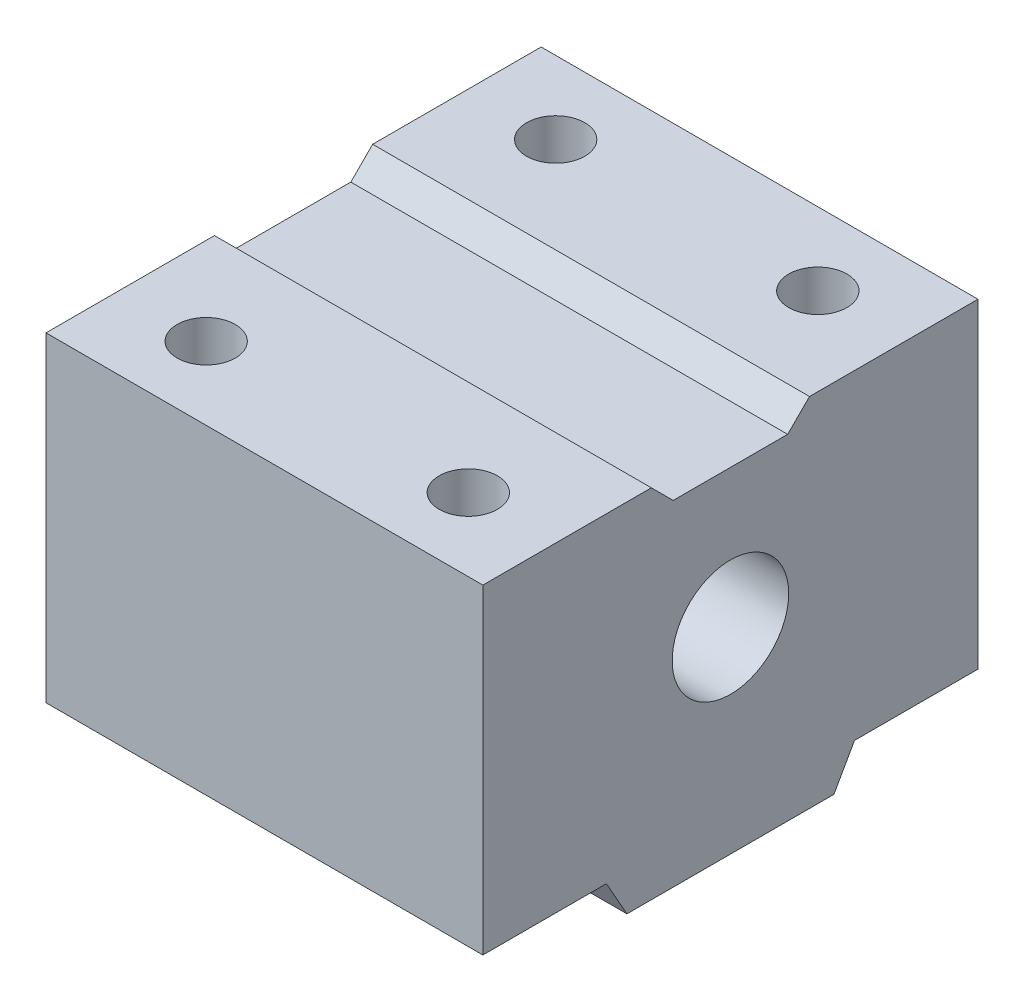
ISO-10303-21;
HEADER;
FILE_DESCRIPTION(('STEP AP214'),'2;1');
FILE_NAME('part.step','',(''),(''),'','','');
FILE_SCHEMA(('AUTOMOTIVE_DESIGN { 1 0 10303 214 1 1 1 1 }'));
ENDSEC;
DATA;
#1=APPLICATION_CONTEXT('core data for automotive mechanical design processes');
#2=APPLICATION_PROTOCOL_DEFINITION('international standard','automotive_design',2000,#1);
#3=PRODUCT_CONTEXT('',#1,'mechanical');
#4=PRODUCT('Part','Part','',(#3));
#5=PRODUCT_RELATED_PRODUCT_CATEGORY('part','',(#4));
#6=PRODUCT_DEFINITION_FORMATION('','',#4);
#7=PRODUCT_DEFINITION_CONTEXT('part definition',#1,'design');
#8=PRODUCT_DEFINITION('design','',#6,#7);
#9=PRODUCT_DEFINITION_SHAPE('','',#8);
#10=(LENGTH_UNIT() NAMED_UNIT(*) SI_UNIT(.MILLI.,.METRE.));
#11=(NAMED_UNIT(*) PLANE_ANGLE_UNIT() SI_UNIT($,.RADIAN.));
#12=(NAMED_UNIT(*) SI_UNIT($,.STERADIAN.) SOLID_ANGLE_UNIT());
#13=UNCERTAINTY_MEASURE_WITH_UNIT(LENGTH_MEASURE(1.E-05),#10,'distance_accuracy_value','');
#14=(GEOMETRIC_REPRESENTATION_CONTEXT(3) GLOBAL_UNCERTAINTY_ASSIGNED_CONTEXT((#13)) GLOBAL_UNIT_ASSIGNED_CONTEXT((#10,
#11,#12)) REPRESENTATION_CONTEXT('',''));
#15=CARTESIAN_POINT('',(0.,0.,0.));
#16=DIRECTION('',(0.,0.,1.));
#17=DIRECTION('',(1.,0.,0.));
#18=AXIS2_PLACEMENT_3D('',#15,#16,#17);
#19=CARTESIAN_POINT('',(0.,22.,0.));
#20=DIRECTION('',(0.,1.,0.));
#21=DIRECTION('',(0.,0.,1.));
#22=AXIS2_PLACEMENT_3D('',#19,#20,#21);
#23=PLANE('',#22);
#24=DIRECTION('',(1.,0.,0.));
#25=VECTOR('',#24,1.);
#26=CARTESIAN_POINT('',(-15.,22.,5.43050564281979));
#27=LINE('',#26,#25);
#28=CARTESIAN_POINT('',(-15.,22.,5.43050564281979));
#29=VERTEX_POINT('',#28);
#30=CARTESIAN_POINT('',(15.,22.,5.43050564281979));
#31=VERTEX_POINT('',#30);
#32=EDGE_CURVE('E146',#29,#31,#27,.T.);
#33=ORIENTED_EDGE('',*,*,#32,.F.);
#34=DIRECTION('',(0.,0.,1.));
#35=VECTOR('',#34,1.);
#36=CARTESIAN_POINT('',(-15.,22.,-17.));
#37=LINE('',#36,#35);
#38=CARTESIAN_POINT('',(-15.,22.,17.));
#39=VERTEX_POINT('',#38);
#40=EDGE_CURVE('E142',#29,#39,#37,.T.);
#41=ORIENTED_EDGE('',*,*,#40,.T.);
#42=DIRECTION('',(1.,0.,0.));
#43=VECTOR('',#42,1.);
#44=CARTESIAN_POINT('',(-15.,22.,17.));
#45=LINE('',#44,#43);
#46=CARTESIAN_POINT('',(15.,22.,17.));
#47=VERTEX_POINT('',#46);
#48=EDGE_CURVE('E141',#39,#47,#45,.T.);
#49=ORIENTED_EDGE('',*,*,#48,.T.);
#50=DIRECTION('',(0.,0.,-1.));
#51=VECTOR('',#50,1.);
#52=CARTESIAN_POINT('',(15.,22.,-17.));
#53=LINE('',#52,#51);
#54=EDGE_CURVE('E209',#47,#31,#53,.T.);
#55=ORIENTED_EDGE('',*,*,#54,.T.);
#56=EDGE_LOOP('',(#33,#41,#49,#55));
#57=FACE_BOUND('',#56,.T.);
#58=CARTESIAN_POINT('',(-9.,22.,12.));
#59=DIRECTION('',(0.,1.,0.));
#60=DIRECTION('',(0.,0.,1.));
#61=AXIS2_PLACEMENT_3D('',#58,#59,#60);
#62=CIRCLE('',#61,2.);
#63=CARTESIAN_POINT('',(-9.,22.,14.));
#64=VERTEX_POINT('',#63);
#65=EDGE_CURVE('E190',#64,#64,#62,.T.);
#66=ORIENTED_EDGE('',*,*,#65,.F.);
#67=EDGE_LOOP('',(#66));
#68=FACE_BOUND('',#67,.T.);
#69=CARTESIAN_POINT('',(9.,22.,12.));
#70=DIRECTION('',(0.,1.,0.));
#71=DIRECTION('',(0.,0.,1.));
#72=AXIS2_PLACEMENT_3D('',#69,#70,#71);
#73=CIRCLE('',#72,2.);
#74=CARTESIAN_POINT('',(9.,22.,14.));
#75=VERTEX_POINT('',#74);
#76=EDGE_CURVE('E178',#75,#75,#73,.T.);
#77=ORIENTED_EDGE('',*,*,#76,.F.);
#78=EDGE_LOOP('',(#77));
#79=FACE_BOUND('',#78,.T.);
#80=ADVANCED_FACE('F36',(#57,#68,#79),#23,.T.);
#81=CARTESIAN_POINT('',(0.,0.,0.));
#82=DIRECTION('',(0.,1.,0.));
#83=DIRECTION('',(0.,0.,1.));
#84=AXIS2_PLACEMENT_3D('',#81,#82,#83);
#85=PLANE('',#84);
#86=CARTESIAN_POINT('',(9.,0.,-12.));
#87=DIRECTION('',(0.,1.,0.));
#88=DIRECTION('',(0.,0.,1.));
#89=AXIS2_PLACEMENT_3D('',#86,#87,#88);
#90=CIRCLE('',#89,2.);
#91=CARTESIAN_POINT('',(9.,0.,-10.));
#92=VERTEX_POINT('',#91);
#93=EDGE_CURVE('E199',#92,#92,#90,.T.);
#94=ORIENTED_EDGE('',*,*,#93,.T.);
#95=EDGE_LOOP('',(#94));
#96=FACE_BOUND('',#95,.T.);
#97=CARTESIAN_POINT('',(-9.,0.,-12.));
#98=DIRECTION('',(0.,1.,0.));
#99=DIRECTION('',(0.,0.,1.));
#100=AXIS2_PLACEMENT_3D('',#97,#98,#99);
#101=CIRCLE('',#100,2.);
#102=CARTESIAN_POINT('',(-9.,0.,-10.));
#103=VERTEX_POINT('',#102);
#104=EDGE_CURVE('E205',#103,#103,#101,.T.);
#105=ORIENTED_EDGE('',*,*,#104,.T.);
#106=EDGE_LOOP('',(#105));
#107=FACE_BOUND('',#106,.T.);
#108=DIRECTION('',(1.,0.,0.));
#109=VECTOR('',#108,1.);
#110=CARTESIAN_POINT('',(-15.,0.,-8.51980993147203));
#111=LINE('',#110,#109);
#112=CARTESIAN_POINT('',(-15.,0.,-8.51980993147203));
#113=VERTEX_POINT('',#112);
#114=CARTESIAN_POINT('',(15.,0.,-8.51980993147204));
#115=VERTEX_POINT('',#114);
#116=EDGE_CURVE('E167',#113,#115,#111,.T.);
#117=ORIENTED_EDGE('',*,*,#116,.F.);
#118=DIRECTION('',(0.,0.,1.));
#119=VECTOR('',#118,1.);
#120=CARTESIAN_POINT('',(-15.,0.,-17.));
#121=LINE('',#120,#119);
#122=CARTESIAN_POINT('',(-15.,0.,-17.));
#123=VERTEX_POINT('',#122);
#124=EDGE_CURVE('E222',#123,#113,#121,.T.);
#125=ORIENTED_EDGE('',*,*,#124,.F.);
#126=DIRECTION('',(-1.,0.,0.));
#127=VECTOR('',#126,1.);
#128=CARTESIAN_POINT('',(-15.,0.,-17.));
#129=LINE('',#128,#127);
#130=CARTESIAN_POINT('',(15.,0.,-17.));
#131=VERTEX_POINT('',#130);
#132=EDGE_CURVE('E219',#131,#123,#129,.T.);
#133=ORIENTED_EDGE('',*,*,#132,.F.);
#134=DIRECTION('',(0.,0.,-1.));
#135=VECTOR('',#134,1.);
#136=CARTESIAN_POINT('',(15.,0.,-17.));
#137=LINE('',#136,#135);
#138=EDGE_CURVE('E208',#115,#131,#137,.T.);
#139=ORIENTED_EDGE('',*,*,#138,.F.);
#140=EDGE_LOOP('',(#117,#125,#133,#139));
#141=FACE_BOUND('',#140,.T.);
#142=ADVANCED_FACE('F262',(#96,#107,#141),#85,.F.);
#143=CARTESIAN_POINT('',(15.,22.,-17.));
#144=DIRECTION('',(-1.,0.,0.));
#145=DIRECTION('',(0.,0.,1.));
#146=AXIS2_PLACEMENT_3D('',#143,#144,#145);
#147=PLANE('',#146);
#148=CARTESIAN_POINT('',(15.,11.,0.));
#149=DIRECTION('',(1.,0.,0.));
#150=DIRECTION('',(0.,0.,-1.));
#151=AXIS2_PLACEMENT_3D('',#148,#149,#150);
#152=CIRCLE('',#151,4.);
#153=CARTESIAN_POINT('',(15.,11.,-4.));
#154=VERTEX_POINT('',#153);
#155=EDGE_CURVE('E153',#154,#154,#152,.T.);
#156=ORIENTED_EDGE('',*,*,#155,.F.);
#157=EDGE_LOOP('',(#156));
#158=FACE_BOUND('',#157,.T.);
#159=DIRECTION('',(0.,0.,-1.));
#160=VECTOR('',#159,1.);
#161=CARTESIAN_POINT('',(15.,20.5,-5.43050564281979));
#162=LINE('',#161,#160);
#163=CARTESIAN_POINT('',(15.,20.5,3.93050564281978));
#164=VERTEX_POINT('',#163);
#165=CARTESIAN_POINT('',(15.,20.5,-3.93050564281978));
#166=VERTEX_POINT('',#165);
#167=EDGE_CURVE('E150',#164,#166,#162,.T.);
#168=ORIENTED_EDGE('',*,*,#167,.F.);
#169=DIRECTION('',(0.,0.707106781186543,0.707106781186552));
#170=VECTOR('',#169,1.);
#171=CARTESIAN_POINT('',(15.,10.7847471785901,-5.78474717859026));
#172=LINE('',#171,#170);
#173=EDGE_CURVE('E45',#164,#31,#172,.T.);
#174=ORIENTED_EDGE('',*,*,#173,.T.);
#175=ORIENTED_EDGE('',*,*,#54,.F.);
#176=DIRECTION('',(0.,-1.,0.));
#177=VECTOR('',#176,1.);
#178=CARTESIAN_POINT('',(15.,22.,17.));
#179=LINE('',#178,#177);
#180=CARTESIAN_POINT('',(15.,0.,17.));
#181=VERTEX_POINT('',#180);
#182=EDGE_CURVE('E215',#47,#181,#179,.T.);
#183=ORIENTED_EDGE('',*,*,#182,.T.);
#184=CARTESIAN_POINT('',(15.,0.,8.51980993147203));
#185=VERTEX_POINT('',#184);
#186=EDGE_CURVE('E216',#181,#185,#137,.T.);
#187=ORIENTED_EDGE('',*,*,#186,.T.);
#188=DIRECTION('',(0.,-0.870479706942139,-0.492204306972143));
#189=VECTOR('',#188,1.);
#190=CARTESIAN_POINT('',(15.,0.,8.51980993147203));
#191=LINE('',#190,#189);
#192=CARTESIAN_POINT('',(15.,-2.5,7.1062091805103));
#193=VERTEX_POINT('',#192);
#194=EDGE_CURVE('E171',#185,#193,#191,.T.);
#195=ORIENTED_EDGE('',*,*,#194,.T.);
#196=DIRECTION('',(0.,0.,-1.));
#197=VECTOR('',#196,1.);
#198=CARTESIAN_POINT('',(15.,-2.49999999999999,-7.1062091805103));
#199=LINE('',#198,#197);
#200=CARTESIAN_POINT('',(15.,-2.49999999999999,-7.1062091805103));
#201=VERTEX_POINT('',#200);
#202=EDGE_CURVE('E161',#193,#201,#199,.T.);
#203=ORIENTED_EDGE('',*,*,#202,.T.);
#204=DIRECTION('',(0.,0.870479706942139,-0.492204306972144));
#205=VECTOR('',#204,1.);
#206=CARTESIAN_POINT('',(15.,0.,-8.51980993147204));
#207=LINE('',#206,#205);
#208=EDGE_CURVE('E168',#201,#115,#207,.T.);
#209=ORIENTED_EDGE('',*,*,#208,.T.);
#210=ORIENTED_EDGE('',*,*,#138,.T.);
#211=DIRECTION('',(0.,-1.,0.));
#212=VECTOR('',#211,1.);
#213=CARTESIAN_POINT('',(15.,22.,-17.));
#214=LINE('',#213,#212);
#215=CARTESIAN_POINT('',(15.,22.,-17.));
#216=VERTEX_POINT('',#215);
#217=EDGE_CURVE('E234',#216,#131,#214,.T.);
#218=ORIENTED_EDGE('',*,*,#217,.F.);
#219=CARTESIAN_POINT('',(15.,22.,-5.43050564281979));
#220=VERTEX_POINT('',#219);
#221=EDGE_CURVE('E212',#220,#216,#53,.T.);
#222=ORIENTED_EDGE('',*,*,#221,.F.);
#223=DIRECTION('',(0.,-0.707106781186543,0.707106781186552));
#224=VECTOR('',#223,1.);
#225=CARTESIAN_POINT('',(15.,27.7847471785901,-11.21525282141));
#226=LINE('',#225,#224);
#227=EDGE_CURVE('E130',#220,#166,#226,.T.);
#228=ORIENTED_EDGE('',*,*,#227,.T.);
#229=EDGE_LOOP('',(#168,#174,#175,#183,#187,#195,#203,#209,#210,#218,#222,#228));
#230=FACE_BOUND('',#229,.T.);
#231=ADVANCED_FACE('F244',(#158,#230),#147,.F.);
#232=CARTESIAN_POINT('',(-15.,22.,-17.));
#233=DIRECTION('',(0.,0.,1.));
#234=DIRECTION('',(1.,0.,0.));
#235=AXIS2_PLACEMENT_3D('',#232,#233,#234);
#236=PLANE('',#235);
#237=ORIENTED_EDGE('',*,*,#132,.T.);
#238=DIRECTION('',(0.,-1.,0.));
#239=VECTOR('',#238,1.);
#240=CARTESIAN_POINT('',(-15.,22.,-17.));
#241=LINE('',#240,#239);
#242=CARTESIAN_POINT('',(-15.,22.,-17.));
#243=VERTEX_POINT('',#242);
#244=EDGE_CURVE('E232',#243,#123,#241,.T.);
#245=ORIENTED_EDGE('',*,*,#244,.F.);
#246=DIRECTION('',(-1.,0.,0.));
#247=VECTOR('',#246,1.);
#248=CARTESIAN_POINT('',(-15.,22.,-17.));
#249=LINE('',#248,#247);
#250=EDGE_CURVE('E139',#216,#243,#249,.T.);
#251=ORIENTED_EDGE('',*,*,#250,.F.);
#252=ORIENTED_EDGE('',*,*,#217,.T.);
#253=EDGE_LOOP('',(#237,#245,#251,#252));
#254=FACE_BOUND('',#253,.T.);
#255=ADVANCED_FACE('F261',(#254),#236,.F.);
#256=CARTESIAN_POINT('',(-15.,22.,-17.));
#257=DIRECTION('',(1.,0.,0.));
#258=DIRECTION('',(0.,0.,-1.));
#259=AXIS2_PLACEMENT_3D('',#256,#257,#258);
#260=PLANE('',#259);
#261=CARTESIAN_POINT('',(-15.,11.,0.));
#262=DIRECTION('',(1.,0.,0.));
#263=DIRECTION('',(0.,0.,-1.));
#264=AXIS2_PLACEMENT_3D('',#261,#262,#263);
#265=CIRCLE('',#264,4.);
#266=CARTESIAN_POINT('',(-15.,11.,-3.99999999999999));
#267=VERTEX_POINT('',#266);
#268=EDGE_CURVE('E147',#267,#267,#265,.T.);
#269=ORIENTED_EDGE('',*,*,#268,.T.);
#270=EDGE_LOOP('',(#269));
#271=FACE_BOUND('',#270,.T.);
#272=ORIENTED_EDGE('',*,*,#40,.F.);
#273=DIRECTION('',(0.,-0.707106781186543,-0.707106781186552));
#274=VECTOR('',#273,1.);
#275=CARTESIAN_POINT('',(-15.,10.7847471785901,-5.78474717859026));
#276=LINE('',#275,#274);
#277=CARTESIAN_POINT('',(-15.,20.5,3.93050564281978));
#278=VERTEX_POINT('',#277);
#279=EDGE_CURVE('E11',#29,#278,#276,.T.);
#280=ORIENTED_EDGE('',*,*,#279,.T.);
#281=DIRECTION('',(0.,0.,1.));
#282=VECTOR('',#281,1.);
#283=CARTESIAN_POINT('',(-15.,20.5,-5.43050564281979));
#284=LINE('',#283,#282);
#285=CARTESIAN_POINT('',(-15.,20.5,-3.93050564281978));
#286=VERTEX_POINT('',#285);
#287=EDGE_CURVE('E129',#286,#278,#284,.T.);
#288=ORIENTED_EDGE('',*,*,#287,.F.);
#289=DIRECTION('',(0.,0.707106781186543,-0.707106781186552));
#290=VECTOR('',#289,1.);
#291=CARTESIAN_POINT('',(-15.,27.7847471785901,-11.21525282141));
#292=LINE('',#291,#290);
#293=CARTESIAN_POINT('',(-15.,22.,-5.43050564281979));
#294=VERTEX_POINT('',#293);
#295=EDGE_CURVE('E58',#286,#294,#292,.T.);
#296=ORIENTED_EDGE('',*,*,#295,.T.);
#297=EDGE_CURVE('E128',#243,#294,#37,.T.);
#298=ORIENTED_EDGE('',*,*,#297,.F.);
#299=ORIENTED_EDGE('',*,*,#244,.T.);
#300=ORIENTED_EDGE('',*,*,#124,.T.);
#301=DIRECTION('',(0.,0.870479706942139,-0.492204306972144));
#302=VECTOR('',#301,1.);
#303=CARTESIAN_POINT('',(-15.,0.,-8.51980993147203));
#304=LINE('',#303,#302);
#305=CARTESIAN_POINT('',(-15.,-2.49999999999999,-7.1062091805103));
#306=VERTEX_POINT('',#305);
#307=EDGE_CURVE('E158',#306,#113,#304,.T.);
#308=ORIENTED_EDGE('',*,*,#307,.F.);
#309=DIRECTION('',(0.,0.,-1.));
#310=VECTOR('',#309,1.);
#311=CARTESIAN_POINT('',(-15.,-2.49999999999999,-7.1062091805103));
#312=LINE('',#311,#310);
#313=CARTESIAN_POINT('',(-15.,-2.5,7.1062091805103));
#314=VERTEX_POINT('',#313);
#315=EDGE_CURVE('E164',#314,#306,#312,.T.);
#316=ORIENTED_EDGE('',*,*,#315,.F.);
#317=DIRECTION('',(0.,-0.870479706942139,-0.492204306972143));
#318=VECTOR('',#317,1.);
#319=CARTESIAN_POINT('',(-15.,0.,8.51980993147204));
#320=LINE('',#319,#318);
#321=CARTESIAN_POINT('',(-15.,0.,8.51980993147204));
#322=VERTEX_POINT('',#321);
#323=EDGE_CURVE('E160',#322,#314,#320,.T.);
#324=ORIENTED_EDGE('',*,*,#323,.F.);
#325=CARTESIAN_POINT('',(-15.,0.,17.));
#326=VERTEX_POINT('',#325);
#327=EDGE_CURVE('E221',#322,#326,#121,.T.);
#328=ORIENTED_EDGE('',*,*,#327,.T.);
#329=DIRECTION('',(0.,-1.,0.));
#330=VECTOR('',#329,1.);
#331=CARTESIAN_POINT('',(-15.,22.,17.));
#332=LINE('',#331,#330);
#333=EDGE_CURVE('E229',#39,#326,#332,.T.);
#334=ORIENTED_EDGE('',*,*,#333,.F.);
#335=EDGE_LOOP('',(#272,#280,#288,#296,#298,#299,#300,#308,#316,#324,#328,#334));
#336=FACE_BOUND('',#335,.T.);
#337=ADVANCED_FACE('F126',(#271,#336),#260,.F.);
#338=CARTESIAN_POINT('',(-15.,22.,17.));
#339=DIRECTION('',(0.,0.,-1.));
#340=DIRECTION('',(-1.,0.,0.));
#341=AXIS2_PLACEMENT_3D('',#338,#339,#340);
#342=PLANE('',#341);
#343=DIRECTION('',(1.,0.,0.));
#344=VECTOR('',#343,1.);
#345=CARTESIAN_POINT('',(-15.,0.,17.));
#346=LINE('',#345,#344);
#347=EDGE_CURVE('E225',#326,#181,#346,.T.);
#348=ORIENTED_EDGE('',*,*,#347,.T.);
#349=ORIENTED_EDGE('',*,*,#182,.F.);
#350=ORIENTED_EDGE('',*,*,#48,.F.);
#351=ORIENTED_EDGE('',*,*,#333,.T.);
#352=EDGE_LOOP('',(#348,#349,#350,#351));
#353=FACE_BOUND('',#352,.T.);
#354=ADVANCED_FACE('F281',(#353),#342,.F.);
#355=DIRECTION('',(-1.,0.,0.));
#356=VECTOR('',#355,1.);
#357=CARTESIAN_POINT('',(-15.,22.,-5.43050564281979));
#358=LINE('',#357,#356);
#359=EDGE_CURVE('E136',#220,#294,#358,.T.);
#360=ORIENTED_EDGE('',*,*,#359,.F.);
#361=ORIENTED_EDGE('',*,*,#221,.T.);
#362=ORIENTED_EDGE('',*,*,#250,.T.);
#363=ORIENTED_EDGE('',*,*,#297,.T.);
#364=EDGE_LOOP('',(#360,#361,#362,#363));
#365=FACE_BOUND('',#364,.T.);
#366=CARTESIAN_POINT('',(9.,22.,-12.));
#367=DIRECTION('',(0.,1.,0.));
#368=DIRECTION('',(0.,0.,1.));
#369=AXIS2_PLACEMENT_3D('',#366,#367,#368);
#370=CIRCLE('',#369,2.);
#371=CARTESIAN_POINT('',(9.,22.,-10.));
#372=VERTEX_POINT('',#371);
#373=EDGE_CURVE('E196',#372,#372,#370,.T.);
#374=ORIENTED_EDGE('',*,*,#373,.F.);
#375=EDGE_LOOP('',(#374));
#376=FACE_BOUND('',#375,.T.);
#377=CARTESIAN_POINT('',(-9.,22.,-12.));
#378=DIRECTION('',(0.,1.,0.));
#379=DIRECTION('',(0.,0.,1.));
#380=AXIS2_PLACEMENT_3D('',#377,#378,#379);
#381=CIRCLE('',#380,2.);
#382=CARTESIAN_POINT('',(-9.,22.,-10.));
#383=VERTEX_POINT('',#382);
#384=EDGE_CURVE('E202',#383,#383,#381,.T.);
#385=ORIENTED_EDGE('',*,*,#384,.F.);
#386=EDGE_LOOP('',(#385));
#387=FACE_BOUND('',#386,.T.);
#388=ADVANCED_FACE('F134',(#365,#376,#387),#23,.T.);
#389=CARTESIAN_POINT('',(9.,0.,12.));
#390=DIRECTION('',(0.,1.,0.));
#391=DIRECTION('',(0.,0.,1.));
#392=AXIS2_PLACEMENT_3D('',#389,#390,#391);
#393=CIRCLE('',#392,2.);
#394=CARTESIAN_POINT('',(9.,0.,14.));
#395=VERTEX_POINT('',#394);
#396=EDGE_CURVE('E187',#395,#395,#393,.T.);
#397=ORIENTED_EDGE('',*,*,#396,.T.);
#398=EDGE_LOOP('',(#397));
#399=FACE_BOUND('',#398,.T.);
#400=CARTESIAN_POINT('',(-9.,0.,12.));
#401=DIRECTION('',(0.,1.,0.));
#402=DIRECTION('',(0.,0.,1.));
#403=AXIS2_PLACEMENT_3D('',#400,#401,#402);
#404=CIRCLE('',#403,2.);
#405=CARTESIAN_POINT('',(-9.,0.,14.));
#406=VERTEX_POINT('',#405);
#407=EDGE_CURVE('E193',#406,#406,#404,.T.);
#408=ORIENTED_EDGE('',*,*,#407,.T.);
#409=EDGE_LOOP('',(#408));
#410=FACE_BOUND('',#409,.T.);
#411=ORIENTED_EDGE('',*,*,#327,.F.);
#412=DIRECTION('',(1.,0.,0.));
#413=VECTOR('',#412,1.);
#414=CARTESIAN_POINT('',(-15.,0.,8.51980993147204));
#415=LINE('',#414,#413);
#416=EDGE_CURVE('E181',#322,#185,#415,.T.);
#417=ORIENTED_EDGE('',*,*,#416,.T.);
#418=ORIENTED_EDGE('',*,*,#186,.F.);
#419=ORIENTED_EDGE('',*,*,#347,.F.);
#420=EDGE_LOOP('',(#411,#417,#418,#419));
#421=FACE_BOUND('',#420,.T.);
#422=ADVANCED_FACE('F274',(#399,#410,#421),#85,.F.);
#423=CARTESIAN_POINT('',(-9.,22.,-12.));
#424=DIRECTION('',(0.,1.,0.));
#425=DIRECTION('',(0.,0.,1.));
#426=AXIS2_PLACEMENT_3D('',#423,#424,#425);
#427=CYLINDRICAL_SURFACE('',#426,2.);
#428=ORIENTED_EDGE('',*,*,#104,.F.);
#429=EDGE_LOOP('',(#428));
#430=FACE_BOUND('',#429,.T.);
#431=ORIENTED_EDGE('',*,*,#384,.T.);
#432=EDGE_LOOP('',(#431));
#433=FACE_BOUND('',#432,.T.);
#434=ADVANCED_FACE('F286',(#430,#433),#427,.F.);
#435=CARTESIAN_POINT('',(9.,22.,-12.));
#436=DIRECTION('',(0.,1.,0.));
#437=DIRECTION('',(0.,0.,1.));
#438=AXIS2_PLACEMENT_3D('',#435,#436,#437);
#439=CYLINDRICAL_SURFACE('',#438,2.);
#440=ORIENTED_EDGE('',*,*,#93,.F.);
#441=EDGE_LOOP('',(#440));
#442=FACE_BOUND('',#441,.T.);
#443=ORIENTED_EDGE('',*,*,#373,.T.);
#444=EDGE_LOOP('',(#443));
#445=FACE_BOUND('',#444,.T.);
#446=ADVANCED_FACE('F332',(#442,#445),#439,.F.);
#447=CARTESIAN_POINT('',(-9.,22.,12.));
#448=DIRECTION('',(0.,1.,0.));
#449=DIRECTION('',(0.,0.,1.));
#450=AXIS2_PLACEMENT_3D('',#447,#448,#449);
#451=CYLINDRICAL_SURFACE('',#450,2.);
#452=ORIENTED_EDGE('',*,*,#407,.F.);
#453=EDGE_LOOP('',(#452));
#454=FACE_BOUND('',#453,.T.);
#455=ORIENTED_EDGE('',*,*,#65,.T.);
#456=EDGE_LOOP('',(#455));
#457=FACE_BOUND('',#456,.T.);
#458=ADVANCED_FACE('F325',(#454,#457),#451,.F.);
#459=CARTESIAN_POINT('',(9.,22.,12.));
#460=DIRECTION('',(0.,1.,0.));
#461=DIRECTION('',(0.,0.,1.));
#462=AXIS2_PLACEMENT_3D('',#459,#460,#461);
#463=CYLINDRICAL_SURFACE('',#462,2.);
#464=ORIENTED_EDGE('',*,*,#396,.F.);
#465=EDGE_LOOP('',(#464));
#466=FACE_BOUND('',#465,.T.);
#467=ORIENTED_EDGE('',*,*,#76,.T.);
#468=EDGE_LOOP('',(#467));
#469=FACE_BOUND('',#468,.T.);
#470=ADVANCED_FACE('F318',(#466,#469),#463,.F.);
#471=CARTESIAN_POINT('',(-15.,0.,-8.51980993147203));
#472=DIRECTION('',(0.,-0.492204306972144,-0.870479706942139));
#473=DIRECTION('',(0.,0.870479706942139,-0.492204306972144));
#474=AXIS2_PLACEMENT_3D('',#471,#472,#473);
#475=PLANE('',#474);
#476=ORIENTED_EDGE('',*,*,#208,.F.);
#477=DIRECTION('',(1.,0.,0.));
#478=VECTOR('',#477,1.);
#479=CARTESIAN_POINT('',(-15.,-2.49999999999999,-7.1062091805103));
#480=LINE('',#479,#478);
#481=EDGE_CURVE('E176',#306,#201,#480,.T.);
#482=ORIENTED_EDGE('',*,*,#481,.F.);
#483=ORIENTED_EDGE('',*,*,#307,.T.);
#484=ORIENTED_EDGE('',*,*,#116,.T.);
#485=EDGE_LOOP('',(#476,#482,#483,#484));
#486=FACE_BOUND('',#485,.T.);
#487=ADVANCED_FACE('F316',(#486),#475,.T.);
#488=CARTESIAN_POINT('',(-15.,-2.49999999999999,-7.1062091805103));
#489=DIRECTION('',(0.,-1.,0.));
#490=DIRECTION('',(0.,0.,-1.));
#491=AXIS2_PLACEMENT_3D('',#488,#489,#490);
#492=PLANE('',#491);
#493=ORIENTED_EDGE('',*,*,#202,.F.);
#494=DIRECTION('',(1.,0.,0.));
#495=VECTOR('',#494,1.);
#496=CARTESIAN_POINT('',(-15.,-2.5,7.1062091805103));
#497=LINE('',#496,#495);
#498=EDGE_CURVE('E179',#314,#193,#497,.T.);
#499=ORIENTED_EDGE('',*,*,#498,.F.);
#500=ORIENTED_EDGE('',*,*,#315,.T.);
#501=ORIENTED_EDGE('',*,*,#481,.T.);
#502=EDGE_LOOP('',(#493,#499,#500,#501));
#503=FACE_BOUND('',#502,.T.);
#504=ADVANCED_FACE('F307',(#503),#492,.T.);
#505=CARTESIAN_POINT('',(-15.,0.,8.51980993147204));
#506=DIRECTION('',(0.,-0.492204306972143,0.870479706942139));
#507=DIRECTION('',(0.,-0.870479706942139,-0.492204306972143));
#508=AXIS2_PLACEMENT_3D('',#505,#506,#507);
#509=PLANE('',#508);
#510=ORIENTED_EDGE('',*,*,#194,.F.);
#511=ORIENTED_EDGE('',*,*,#416,.F.);
#512=ORIENTED_EDGE('',*,*,#323,.T.);
#513=ORIENTED_EDGE('',*,*,#498,.T.);
#514=EDGE_LOOP('',(#510,#511,#512,#513));
#515=FACE_BOUND('',#514,.T.);
#516=ADVANCED_FACE('F302',(#515),#509,.T.);
#517=CARTESIAN_POINT('',(0.,20.5,0.));
#518=DIRECTION('',(0.,1.,0.));
#519=DIRECTION('',(0.,0.,1.));
#520=AXIS2_PLACEMENT_3D('',#517,#518,#519);
#521=PLANE('',#520);
#522=ORIENTED_EDGE('',*,*,#167,.T.);
#523=DIRECTION('',(-1.,0.,0.));
#524=VECTOR('',#523,1.);
#525=CARTESIAN_POINT('',(0.,20.5,-3.93050564281978));
#526=LINE('',#525,#524);
#527=EDGE_CURVE('E131',#166,#286,#526,.T.);
#528=ORIENTED_EDGE('',*,*,#527,.T.);
#529=ORIENTED_EDGE('',*,*,#287,.T.);
#530=DIRECTION('',(1.,0.,0.));
#531=VECTOR('',#530,1.);
#532=CARTESIAN_POINT('',(0.,20.5,3.93050564281978));
#533=LINE('',#532,#531);
#534=EDGE_CURVE('E237',#278,#164,#533,.T.);
#535=ORIENTED_EDGE('',*,*,#534,.T.);
#536=EDGE_LOOP('',(#522,#528,#529,#535));
#537=FACE_BOUND('',#536,.T.);
#538=ADVANCED_FACE('F253',(#537),#521,.T.);
#539=CARTESIAN_POINT('',(0.,20.5,-3.93050564281978));
#540=DIRECTION('',(0.,-0.707106781186552,-0.707106781186543));
#541=DIRECTION('',(-1.,0.,0.));
#542=AXIS2_PLACEMENT_3D('',#539,#540,#541);
#543=PLANE('',#542);
#544=ORIENTED_EDGE('',*,*,#227,.F.);
#545=ORIENTED_EDGE('',*,*,#359,.T.);
#546=ORIENTED_EDGE('',*,*,#295,.F.);
#547=ORIENTED_EDGE('',*,*,#527,.F.);
#548=EDGE_LOOP('',(#544,#545,#546,#547));
#549=FACE_BOUND('',#548,.T.);
#550=ADVANCED_FACE('F145',(#549),#543,.F.);
#551=CARTESIAN_POINT('',(0.,20.5,3.93050564281978));
#552=DIRECTION('',(0.,-0.707106781186552,0.707106781186543));
#553=DIRECTION('',(1.,0.,0.));
#554=AXIS2_PLACEMENT_3D('',#551,#552,#553);
#555=PLANE('',#554);
#556=ORIENTED_EDGE('',*,*,#279,.F.);
#557=ORIENTED_EDGE('',*,*,#32,.T.);
#558=ORIENTED_EDGE('',*,*,#173,.F.);
#559=ORIENTED_EDGE('',*,*,#534,.F.);
#560=EDGE_LOOP('',(#556,#557,#558,#559));
#561=FACE_BOUND('',#560,.T.);
#562=ADVANCED_FACE('F39',(#561),#555,.F.);
#563=CARTESIAN_POINT('',(-15.,11.,0.));
#564=DIRECTION('',(1.,0.,0.));
#565=DIRECTION('',(0.,0.,-1.));
#566=AXIS2_PLACEMENT_3D('',#563,#564,#565);
#567=CYLINDRICAL_SURFACE('',#566,4.);
#568=ORIENTED_EDGE('',*,*,#268,.F.);
#569=EDGE_LOOP('',(#568));
#570=FACE_BOUND('',#569,.T.);
#571=ORIENTED_EDGE('',*,*,#155,.T.);
#572=EDGE_LOOP('',(#571));
#573=FACE_BOUND('',#572,.T.);
#574=ADVANCED_FACE('F258',(#570,#573),#567,.F.);
#575=CLOSED_SHELL('',(#80,#142,#231,#255,#337,#354,#388,#422,#434,#446,#458,#470,#487,#504,#516,
#538,#550,#562,#574));
#576=MANIFOLD_SOLID_BREP('B2',#575);
#577=ADVANCED_BREP_SHAPE_REPRESENTATION('',(#18,#576),#14);
#578=SHAPE_DEFINITION_REPRESENTATION(#9,#577);
ENDSEC;
END-ISO-10303-21;
